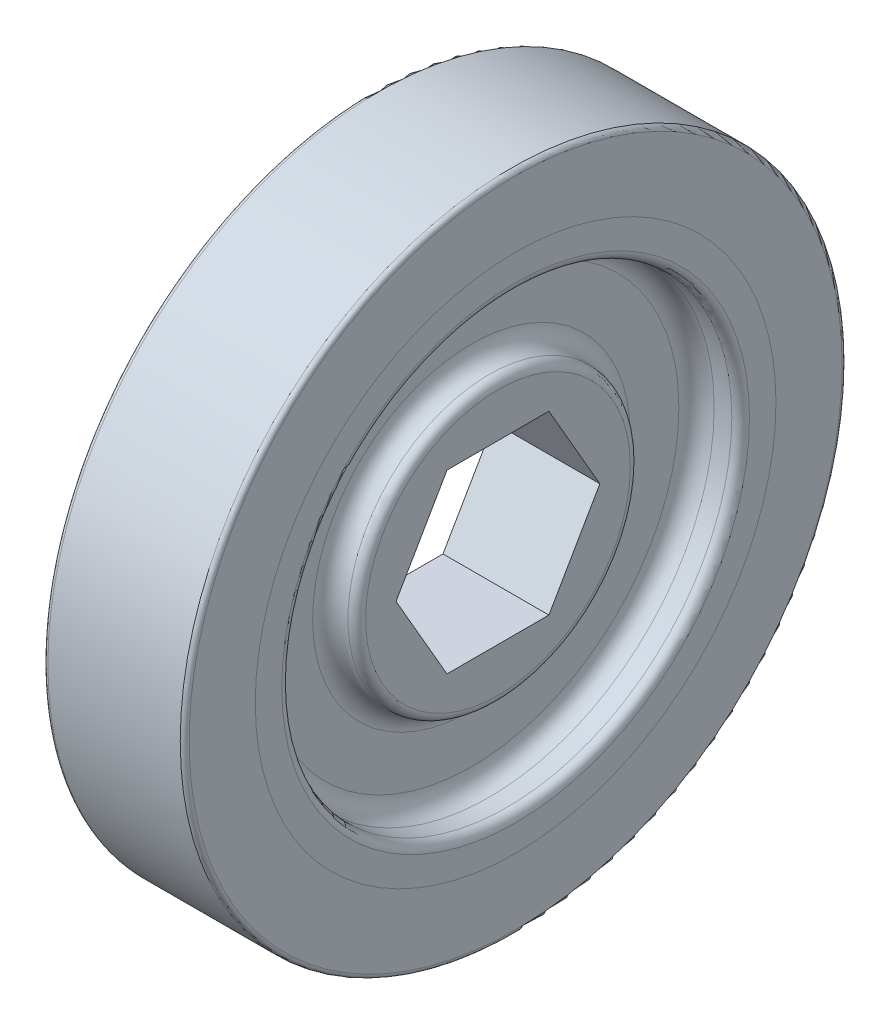
ISO-10303-21;
HEADER;
FILE_DESCRIPTION(('STEP AP214'),'2;1');
FILE_NAME('part.step','',(''),(''),'','','');
FILE_SCHEMA(('AUTOMOTIVE_DESIGN { 1 0 10303 214 1 1 1 1 }'));
ENDSEC;
DATA;
#1=APPLICATION_CONTEXT('core data for automotive mechanical design processes');
#2=APPLICATION_PROTOCOL_DEFINITION('international standard','automotive_design',2000,#1);
#3=PRODUCT_CONTEXT('',#1,'mechanical');
#4=PRODUCT('Part','Part','',(#3));
#5=PRODUCT_RELATED_PRODUCT_CATEGORY('part','',(#4));
#6=PRODUCT_DEFINITION_FORMATION('','',#4);
#7=PRODUCT_DEFINITION_CONTEXT('part definition',#1,'design');
#8=PRODUCT_DEFINITION('design','',#6,#7);
#9=PRODUCT_DEFINITION_SHAPE('','',#8);
#10=(LENGTH_UNIT() NAMED_UNIT(*) SI_UNIT(.MILLI.,.METRE.));
#11=(NAMED_UNIT(*) PLANE_ANGLE_UNIT() SI_UNIT($,.RADIAN.));
#12=(NAMED_UNIT(*) SI_UNIT($,.STERADIAN.) SOLID_ANGLE_UNIT());
#13=UNCERTAINTY_MEASURE_WITH_UNIT(LENGTH_MEASURE(1.E-05),#10,'distance_accuracy_value','');
#14=(GEOMETRIC_REPRESENTATION_CONTEXT(3) GLOBAL_UNCERTAINTY_ASSIGNED_CONTEXT((#13)) GLOBAL_UNIT_ASSIGNED_CONTEXT((#10,
#11,#12)) REPRESENTATION_CONTEXT('',''));
#15=CARTESIAN_POINT('',(0.,0.,0.));
#16=DIRECTION('',(0.,0.,1.));
#17=DIRECTION('',(1.,0.,0.));
#18=AXIS2_PLACEMENT_3D('',#15,#16,#17);
#19=CARTESIAN_POINT('',(4.7625,0.,0.));
#20=DIRECTION('',(1.,0.,0.));
#21=DIRECTION('',(0.,0.,-1.));
#22=AXIS2_PLACEMENT_3D('',#19,#20,#21);
#23=TOROIDAL_SURFACE('',#22,23.495,0.3175);
#24=CARTESIAN_POINT('',(4.7625,0.,0.));
#25=DIRECTION('',(-1.,0.,0.));
#26=DIRECTION('',(0.,0.,-1.));
#27=AXIS2_PLACEMENT_3D('',#24,#25,#26);
#28=CIRCLE('',#27,23.8125);
#29=CARTESIAN_POINT('',(4.7625,0.,-23.8125));
#30=VERTEX_POINT('',#29);
#31=EDGE_CURVE('P0_E26',#30,#30,#28,.T.);
#32=ORIENTED_EDGE('',*,*,#31,.F.);
#33=EDGE_LOOP('',(#32));
#34=FACE_BOUND('',#33,.T.);
#35=CARTESIAN_POINT('',(5.08,0.,0.));
#36=DIRECTION('',(1.,0.,0.));
#37=DIRECTION('',(0.,0.,-1.));
#38=AXIS2_PLACEMENT_3D('',#35,#36,#37);
#39=CIRCLE('',#38,23.495);
#40=CARTESIAN_POINT('',(5.08,0.,-23.495));
#41=VERTEX_POINT('',#40);
#42=EDGE_CURVE('P0_E86',#41,#41,#39,.T.);
#43=ORIENTED_EDGE('',*,*,#42,.F.);
#44=EDGE_LOOP('',(#43));
#45=FACE_BOUND('',#44,.T.);
#46=ADVANCED_FACE('P0_F16',(#34,#45),#23,.T.);
#47=CARTESIAN_POINT('',(-4.7625,0.,0.));
#48=DIRECTION('',(1.,0.,0.));
#49=DIRECTION('',(0.,0.,-1.));
#50=AXIS2_PLACEMENT_3D('',#47,#48,#49);
#51=TOROIDAL_SURFACE('',#50,23.495,0.3175);
#52=CARTESIAN_POINT('',(-5.08,0.,0.));
#53=DIRECTION('',(-1.,0.,0.));
#54=DIRECTION('',(0.,0.,-1.));
#55=AXIS2_PLACEMENT_3D('',#52,#53,#54);
#56=CIRCLE('',#55,23.495);
#57=CARTESIAN_POINT('',(-5.08,0.,-23.495));
#58=VERTEX_POINT('',#57);
#59=EDGE_CURVE('P0_E90',#58,#58,#56,.T.);
#60=ORIENTED_EDGE('',*,*,#59,.F.);
#61=EDGE_LOOP('',(#60));
#62=FACE_BOUND('',#61,.T.);
#63=CARTESIAN_POINT('',(-4.7625,0.,0.));
#64=DIRECTION('',(1.,0.,0.));
#65=DIRECTION('',(0.,0.,-1.));
#66=AXIS2_PLACEMENT_3D('',#63,#64,#65);
#67=CIRCLE('',#66,23.8125);
#68=CARTESIAN_POINT('',(-4.7625,0.,-23.8125));
#69=VERTEX_POINT('',#68);
#70=EDGE_CURVE('P0_E11',#69,#69,#67,.T.);
#71=ORIENTED_EDGE('',*,*,#70,.F.);
#72=EDGE_LOOP('',(#71));
#73=FACE_BOUND('',#72,.T.);
#74=ADVANCED_FACE('P0_F128',(#62,#73),#51,.T.);
#75=CARTESIAN_POINT('',(5.08,0.,0.));
#76=DIRECTION('',(1.,0.,0.));
#77=DIRECTION('',(0.,0.,1.));
#78=AXIS2_PLACEMENT_3D('',#75,#76,#77);
#79=CYLINDRICAL_SURFACE('',#78,23.8125);
#80=ORIENTED_EDGE('',*,*,#70,.T.);
#81=EDGE_LOOP('',(#80));
#82=FACE_BOUND('',#81,.T.);
#83=ORIENTED_EDGE('',*,*,#31,.T.);
#84=EDGE_LOOP('',(#83));
#85=FACE_BOUND('',#84,.T.);
#86=ADVANCED_FACE('P0_F133',(#82,#85),#79,.T.);
#87=CARTESIAN_POINT('',(-5.08,0.,0.));
#88=DIRECTION('',(1.,0.,0.));
#89=DIRECTION('',(0.,1.,0.));
#90=AXIS2_PLACEMENT_3D('',#87,#88,#89);
#91=PLANE('',#90);
#92=CARTESIAN_POINT('',(-5.08,0.,0.));
#93=DIRECTION('',(1.,0.,0.));
#94=DIRECTION('',(0.,0.,-1.));
#95=AXIS2_PLACEMENT_3D('',#92,#93,#94);
#96=CIRCLE('',#95,18.7325);
#97=CARTESIAN_POINT('',(-5.08,0.,-18.7325));
#98=VERTEX_POINT('',#97);
#99=EDGE_CURVE('P0_E20',#98,#98,#96,.T.);
#100=ORIENTED_EDGE('',*,*,#99,.T.);
#101=EDGE_LOOP('',(#100));
#102=FACE_BOUND('',#101,.T.);
#103=ORIENTED_EDGE('',*,*,#59,.T.);
#104=EDGE_LOOP('',(#103));
#105=FACE_BOUND('',#104,.T.);
#106=ADVANCED_FACE('P0_F124',(#102,#105),#91,.F.);
#107=CARTESIAN_POINT('',(5.08,0.,0.));
#108=DIRECTION('',(1.,0.,0.));
#109=DIRECTION('',(0.,1.,0.));
#110=AXIS2_PLACEMENT_3D('',#107,#108,#109);
#111=PLANE('',#110);
#112=CARTESIAN_POINT('',(5.08,0.,0.));
#113=DIRECTION('',(1.,0.,0.));
#114=DIRECTION('',(0.,0.,-1.));
#115=AXIS2_PLACEMENT_3D('',#112,#113,#114);
#116=CIRCLE('',#115,18.7325);
#117=CARTESIAN_POINT('',(5.08,0.,-18.7325));
#118=VERTEX_POINT('',#117);
#119=EDGE_CURVE('P0_E91',#118,#118,#116,.T.);
#120=ORIENTED_EDGE('',*,*,#119,.F.);
#121=EDGE_LOOP('',(#120));
#122=FACE_BOUND('',#121,.T.);
#123=ORIENTED_EDGE('',*,*,#42,.T.);
#124=EDGE_LOOP('',(#123));
#125=FACE_BOUND('',#124,.T.);
#126=ADVANCED_FACE('P0_F87',(#122,#125),#111,.T.);
#127=CARTESIAN_POINT('',(5.08,0.,0.));
#128=DIRECTION('',(1.,0.,0.));
#129=DIRECTION('',(0.,0.,1.));
#130=AXIS2_PLACEMENT_3D('',#127,#128,#129);
#131=CYLINDRICAL_SURFACE('',#130,18.7325);
#132=ORIENTED_EDGE('',*,*,#119,.T.);
#133=EDGE_LOOP('',(#132));
#134=FACE_BOUND('',#133,.T.);
#135=CARTESIAN_POINT('',(2.54,0.,0.));
#136=DIRECTION('',(1.,0.,0.));
#137=DIRECTION('',(0.,0.,-1.));
#138=AXIS2_PLACEMENT_3D('',#135,#136,#137);
#139=CIRCLE('',#138,18.7325);
#140=CARTESIAN_POINT('',(2.54,0.,-18.7325));
#141=VERTEX_POINT('',#140);
#142=EDGE_CURVE('P0_E98',#141,#141,#139,.T.);
#143=ORIENTED_EDGE('',*,*,#142,.F.);
#144=EDGE_LOOP('',(#143));
#145=FACE_BOUND('',#144,.T.);
#146=ADVANCED_FACE('P0_F18',(#134,#145),#131,.F.);
#147=CARTESIAN_POINT('',(2.54,0.,0.));
#148=DIRECTION('',(1.,0.,0.));
#149=DIRECTION('',(0.,1.,0.));
#150=AXIS2_PLACEMENT_3D('',#147,#148,#149);
#151=PLANE('',#150);
#152=ORIENTED_EDGE('',*,*,#142,.T.);
#153=EDGE_LOOP('',(#152));
#154=FACE_BOUND('',#153,.T.);
#155=CARTESIAN_POINT('',(2.54,0.,0.));
#156=DIRECTION('',(1.,0.,0.));
#157=DIRECTION('',(0.,0.,-1.));
#158=AXIS2_PLACEMENT_3D('',#155,#156,#157);
#159=CIRCLE('',#158,21.2725);
#160=CARTESIAN_POINT('',(2.54,0.,-21.2725));
#161=VERTEX_POINT('',#160);
#162=EDGE_CURVE('P0_E57',#161,#161,#159,.T.);
#163=ORIENTED_EDGE('',*,*,#162,.F.);
#164=EDGE_LOOP('',(#163));
#165=FACE_BOUND('',#164,.T.);
#166=ADVANCED_FACE('P0_F112',(#154,#165),#151,.F.);
#167=CARTESIAN_POINT('',(5.08,0.,0.));
#168=DIRECTION('',(1.,0.,0.));
#169=DIRECTION('',(0.,0.,1.));
#170=AXIS2_PLACEMENT_3D('',#167,#168,#169);
#171=CYLINDRICAL_SURFACE('',#170,21.2725);
#172=CARTESIAN_POINT('',(-2.54,0.,0.));
#173=DIRECTION('',(1.,0.,0.));
#174=DIRECTION('',(0.,0.,-1.));
#175=AXIS2_PLACEMENT_3D('',#172,#173,#174);
#176=CIRCLE('',#175,21.2725);
#177=CARTESIAN_POINT('',(-2.54,0.,-21.2725));
#178=VERTEX_POINT('',#177);
#179=EDGE_CURVE('P0_E66',#178,#178,#176,.T.);
#180=ORIENTED_EDGE('',*,*,#179,.F.);
#181=EDGE_LOOP('',(#180));
#182=FACE_BOUND('',#181,.T.);
#183=ORIENTED_EDGE('',*,*,#162,.T.);
#184=EDGE_LOOP('',(#183));
#185=FACE_BOUND('',#184,.T.);
#186=ADVANCED_FACE('P0_F122',(#182,#185),#171,.F.);
#187=CARTESIAN_POINT('',(-2.54,0.,0.));
#188=DIRECTION('',(1.,0.,0.));
#189=DIRECTION('',(0.,1.,0.));
#190=AXIS2_PLACEMENT_3D('',#187,#188,#189);
#191=PLANE('',#190);
#192=CARTESIAN_POINT('',(-2.54,0.,0.));
#193=DIRECTION('',(1.,0.,0.));
#194=DIRECTION('',(0.,0.,-1.));
#195=AXIS2_PLACEMENT_3D('',#192,#193,#194);
#196=CIRCLE('',#195,18.7325);
#197=CARTESIAN_POINT('',(-2.54,0.,-18.7325));
#198=VERTEX_POINT('',#197);
#199=EDGE_CURVE('P0_E154',#198,#198,#196,.T.);
#200=ORIENTED_EDGE('',*,*,#199,.F.);
#201=EDGE_LOOP('',(#200));
#202=FACE_BOUND('',#201,.T.);
#203=ORIENTED_EDGE('',*,*,#179,.T.);
#204=EDGE_LOOP('',(#203));
#205=FACE_BOUND('',#204,.T.);
#206=ADVANCED_FACE('P0_F139',(#202,#205),#191,.T.);
#207=CARTESIAN_POINT('',(-5.08,0.,0.));
#208=DIRECTION('',(-1.,0.,0.));
#209=DIRECTION('',(0.,0.,-1.));
#210=AXIS2_PLACEMENT_3D('',#207,#208,#209);
#211=CYLINDRICAL_SURFACE('',#210,18.7325);
#212=ORIENTED_EDGE('',*,*,#99,.F.);
#213=EDGE_LOOP('',(#212));
#214=FACE_BOUND('',#213,.T.);
#215=ORIENTED_EDGE('',*,*,#199,.T.);
#216=EDGE_LOOP('',(#215));
#217=FACE_BOUND('',#216,.T.);
#218=ADVANCED_FACE('P0_F141',(#214,#217),#211,.F.);
#219=CLOSED_SHELL('',(#46,#74,#86,#106,#126,#146,#166,#186,#206,#218));
#220=MANIFOLD_SOLID_BREP('P0_B1',#219);
#221=CARTESIAN_POINT('',(1.905,0.,0.));
#222=DIRECTION('',(1.,0.,0.));
#223=DIRECTION('',(0.,1.,0.));
#224=AXIS2_PLACEMENT_3D('',#221,#222,#223);
#225=PLANE('',#224);
#226=CARTESIAN_POINT('',(1.905,0.,0.));
#227=DIRECTION('',(-1.,0.,0.));
#228=DIRECTION('',(0.,0.,-1.));
#229=AXIS2_PLACEMENT_3D('',#226,#227,#228);
#230=CIRCLE('',#229,11.43);
#231=CARTESIAN_POINT('',(1.905,0.,-11.43));
#232=VERTEX_POINT('',#231);
#233=EDGE_CURVE('P1_E206',#232,#232,#230,.T.);
#234=ORIENTED_EDGE('',*,*,#233,.T.);
#235=EDGE_LOOP('',(#234));
#236=FACE_BOUND('',#235,.T.);
#237=CARTESIAN_POINT('',(1.905,0.,0.));
#238=DIRECTION('',(1.,0.,0.));
#239=DIRECTION('',(0.,0.,-1.));
#240=AXIS2_PLACEMENT_3D('',#237,#238,#239);
#241=CIRCLE('',#240,14.9225);
#242=CARTESIAN_POINT('',(1.905,0.,-14.9225));
#243=VERTEX_POINT('',#242);
#244=EDGE_CURVE('P1_E207',#243,#243,#241,.T.);
#245=ORIENTED_EDGE('',*,*,#244,.T.);
#246=EDGE_LOOP('',(#245));
#247=FACE_BOUND('',#246,.T.);
#248=ADVANCED_FACE('P1_F16',(#236,#247),#225,.T.);
#249=CARTESIAN_POINT('',(-3.81,0.,0.));
#250=DIRECTION('',(1.,0.,0.));
#251=DIRECTION('',(0.,1.,0.));
#252=AXIS2_PLACEMENT_3D('',#249,#250,#251);
#253=PLANE('',#252);
#254=DIRECTION('',(0.,0.,1.));
#255=VECTOR('',#254,1.);
#256=CARTESIAN_POINT('',(-3.81,6.35,0.));
#257=LINE('',#256,#255);
#258=CARTESIAN_POINT('',(-3.81,6.35,-3.66617420935413));
#259=VERTEX_POINT('',#258);
#260=CARTESIAN_POINT('',(-3.81,6.35,3.66617420935413));
#261=VERTEX_POINT('',#260);
#262=EDGE_CURVE('P1_E203',#259,#261,#257,.T.);
#263=ORIENTED_EDGE('',*,*,#262,.T.);
#264=DIRECTION('',(0.,-0.866025403784439,0.5));
#265=VECTOR('',#264,1.);
#266=CARTESIAN_POINT('',(-3.81,3.175,5.49926131403119));
#267=LINE('',#266,#265);
#268=CARTESIAN_POINT('',(-3.81,0.,7.33234841870825));
#269=VERTEX_POINT('',#268);
#270=EDGE_CURVE('P1_E99',#261,#269,#267,.T.);
#271=ORIENTED_EDGE('',*,*,#270,.T.);
#272=DIRECTION('',(0.,-0.866025403784439,-0.5));
#273=VECTOR('',#272,1.);
#274=CARTESIAN_POINT('',(-3.81,-3.175,5.49926131403119));
#275=LINE('',#274,#273);
#276=CARTESIAN_POINT('',(-3.81,-6.35,3.66617420935413));
#277=VERTEX_POINT('',#276);
#278=EDGE_CURVE('P1_E253',#269,#277,#275,.T.);
#279=ORIENTED_EDGE('',*,*,#278,.T.);
#280=DIRECTION('',(0.,0.,-1.));
#281=VECTOR('',#280,1.);
#282=CARTESIAN_POINT('',(-3.81,-6.35,0.));
#283=LINE('',#282,#281);
#284=CARTESIAN_POINT('',(-3.81,-6.35,-3.66617420935412));
#285=VERTEX_POINT('',#284);
#286=EDGE_CURVE('P1_E349',#277,#285,#283,.T.);
#287=ORIENTED_EDGE('',*,*,#286,.T.);
#288=DIRECTION('',(0.,0.866025403784439,-0.5));
#289=VECTOR('',#288,1.);
#290=CARTESIAN_POINT('',(-3.81,-3.175,-5.49926131403118));
#291=LINE('',#290,#289);
#292=CARTESIAN_POINT('',(-3.81,0.,-7.33234841870825));
#293=VERTEX_POINT('',#292);
#294=EDGE_CURVE('P1_E246',#285,#293,#291,.T.);
#295=ORIENTED_EDGE('',*,*,#294,.T.);
#296=DIRECTION('',(0.,0.866025403784439,0.5));
#297=VECTOR('',#296,1.);
#298=CARTESIAN_POINT('',(-3.81,3.175,-5.49926131403119));
#299=LINE('',#298,#297);
#300=EDGE_CURVE('P1_E216',#293,#259,#299,.T.);
#301=ORIENTED_EDGE('',*,*,#300,.T.);
#302=EDGE_LOOP('',(#263,#271,#279,#287,#295,#301));
#303=FACE_BOUND('',#302,.T.);
#304=CARTESIAN_POINT('',(-3.81,0.,0.));
#305=DIRECTION('',(-1.,0.,0.));
#306=DIRECTION('',(0.,0.,-1.));
#307=AXIS2_PLACEMENT_3D('',#304,#305,#306);
#308=CIRCLE('',#307,9.525);
#309=CARTESIAN_POINT('',(-3.81,0.,-9.525));
#310=VERTEX_POINT('',#309);
#311=EDGE_CURVE('P1_E177',#310,#310,#308,.T.);
#312=ORIENTED_EDGE('',*,*,#311,.T.);
#313=EDGE_LOOP('',(#312));
#314=FACE_BOUND('',#313,.T.);
#315=ADVANCED_FACE('P1_F178',(#303,#314),#253,.F.);
#316=CARTESIAN_POINT('',(-5.08,0.,0.));
#317=DIRECTION('',(1.,0.,0.));
#318=DIRECTION('',(0.,1.,0.));
#319=AXIS2_PLACEMENT_3D('',#316,#317,#318);
#320=PLANE('',#319);
#321=CARTESIAN_POINT('',(-5.08,0.,0.));
#322=DIRECTION('',(1.,0.,0.));
#323=DIRECTION('',(0.,0.,-1.));
#324=AXIS2_PLACEMENT_3D('',#321,#322,#323);
#325=CIRCLE('',#324,16.8275);
#326=CARTESIAN_POINT('',(-5.08,0.,-16.8275));
#327=VERTEX_POINT('',#326);
#328=EDGE_CURVE('P1_E213',#327,#327,#325,.T.);
#329=ORIENTED_EDGE('',*,*,#328,.T.);
#330=EDGE_LOOP('',(#329));
#331=FACE_BOUND('',#330,.T.);
#332=CARTESIAN_POINT('',(-5.08,0.,0.));
#333=DIRECTION('',(1.,0.,0.));
#334=DIRECTION('',(0.,0.,-1.));
#335=AXIS2_PLACEMENT_3D('',#332,#333,#334);
#336=CIRCLE('',#335,18.7325);
#337=CARTESIAN_POINT('',(-5.08,0.,-18.7325));
#338=VERTEX_POINT('',#337);
#339=EDGE_CURVE('P1_E240',#338,#338,#336,.T.);
#340=ORIENTED_EDGE('',*,*,#339,.F.);
#341=EDGE_LOOP('',(#340));
#342=FACE_BOUND('',#341,.T.);
#343=ADVANCED_FACE('P1_F300',(#331,#342),#320,.F.);
#344=CARTESIAN_POINT('',(2.54,0.,0.));
#345=DIRECTION('',(1.,0.,0.));
#346=DIRECTION('',(0.,0.,1.));
#347=AXIS2_PLACEMENT_3D('',#344,#345,#346);
#348=CYLINDRICAL_SURFACE('',#347,21.2725);
#349=CARTESIAN_POINT('',(2.54,0.,0.));
#350=DIRECTION('',(1.,0.,0.));
#351=DIRECTION('',(0.,0.,-1.));
#352=AXIS2_PLACEMENT_3D('',#349,#350,#351);
#353=CIRCLE('',#352,21.2725);
#354=CARTESIAN_POINT('',(2.54,0.,-21.2725));
#355=VERTEX_POINT('',#354);
#356=EDGE_CURVE('P1_E11',#355,#355,#353,.T.);
#357=ORIENTED_EDGE('',*,*,#356,.F.);
#358=EDGE_LOOP('',(#357));
#359=FACE_BOUND('',#358,.T.);
#360=CARTESIAN_POINT('',(-2.54,0.,0.));
#361=DIRECTION('',(1.,0.,0.));
#362=DIRECTION('',(0.,0.,-1.));
#363=AXIS2_PLACEMENT_3D('',#360,#361,#362);
#364=CIRCLE('',#363,21.2725);
#365=CARTESIAN_POINT('',(-2.54,0.,-21.2725));
#366=VERTEX_POINT('',#365);
#367=EDGE_CURVE('P1_E27',#366,#366,#364,.T.);
#368=ORIENTED_EDGE('',*,*,#367,.T.);
#369=EDGE_LOOP('',(#368));
#370=FACE_BOUND('',#369,.T.);
#371=ADVANCED_FACE('P1_F305',(#359,#370),#348,.T.);
#372=CARTESIAN_POINT('',(2.54,0.,0.));
#373=DIRECTION('',(1.,0.,0.));
#374=DIRECTION('',(0.,1.,0.));
#375=AXIS2_PLACEMENT_3D('',#372,#373,#374);
#376=PLANE('',#375);
#377=CARTESIAN_POINT('',(2.54,0.,0.));
#378=DIRECTION('',(1.,0.,0.));
#379=DIRECTION('',(0.,0.,-1.));
#380=AXIS2_PLACEMENT_3D('',#377,#378,#379);
#381=CIRCLE('',#380,18.7325);
#382=CARTESIAN_POINT('',(2.54,0.,-18.7325));
#383=VERTEX_POINT('',#382);
#384=EDGE_CURVE('P1_E196',#383,#383,#381,.T.);
#385=ORIENTED_EDGE('',*,*,#384,.F.);
#386=EDGE_LOOP('',(#385));
#387=FACE_BOUND('',#386,.T.);
#388=ORIENTED_EDGE('',*,*,#356,.T.);
#389=EDGE_LOOP('',(#388));
#390=FACE_BOUND('',#389,.T.);
#391=ADVANCED_FACE('P1_F383',(#387,#390),#376,.T.);
#392=CARTESIAN_POINT('',(-2.54,0.,0.));
#393=DIRECTION('',(1.,0.,0.));
#394=DIRECTION('',(0.,1.,0.));
#395=AXIS2_PLACEMENT_3D('',#392,#393,#394);
#396=PLANE('',#395);
#397=CARTESIAN_POINT('',(-2.54,0.,0.));
#398=DIRECTION('',(1.,0.,0.));
#399=DIRECTION('',(0.,0.,-1.));
#400=AXIS2_PLACEMENT_3D('',#397,#398,#399);
#401=CIRCLE('',#400,18.7325);
#402=CARTESIAN_POINT('',(-2.54,0.,-18.7325));
#403=VERTEX_POINT('',#402);
#404=EDGE_CURVE('P1_E53',#403,#403,#401,.T.);
#405=ORIENTED_EDGE('',*,*,#404,.T.);
#406=EDGE_LOOP('',(#405));
#407=FACE_BOUND('',#406,.T.);
#408=ORIENTED_EDGE('',*,*,#367,.F.);
#409=EDGE_LOOP('',(#408));
#410=FACE_BOUND('',#409,.T.);
#411=ADVANCED_FACE('P1_F311',(#407,#410),#396,.F.);
#412=CARTESIAN_POINT('',(3.175,0.,0.));
#413=DIRECTION('',(1.,0.,0.));
#414=DIRECTION('',(0.,0.,-1.));
#415=AXIS2_PLACEMENT_3D('',#412,#413,#414);
#416=TOROIDAL_SURFACE('',#415,9.525,0.635);
#417=CARTESIAN_POINT('',(3.175,0.,0.));
#418=DIRECTION('',(1.,0.,0.));
#419=DIRECTION('',(0.,0.,-1.));
#420=AXIS2_PLACEMENT_3D('',#417,#418,#419);
#421=CIRCLE('',#420,10.16);
#422=CARTESIAN_POINT('',(3.175,0.,-10.16));
#423=VERTEX_POINT('',#422);
#424=EDGE_CURVE('P1_E204',#423,#423,#421,.T.);
#425=ORIENTED_EDGE('',*,*,#424,.T.);
#426=EDGE_LOOP('',(#425));
#427=FACE_BOUND('',#426,.T.);
#428=CARTESIAN_POINT('',(3.81,0.,0.));
#429=DIRECTION('',(1.,0.,0.));
#430=DIRECTION('',(0.,0.,-1.));
#431=AXIS2_PLACEMENT_3D('',#428,#429,#430);
#432=CIRCLE('',#431,9.525);
#433=CARTESIAN_POINT('',(3.81,0.,-9.525));
#434=VERTEX_POINT('',#433);
#435=EDGE_CURVE('P1_E263',#434,#434,#432,.T.);
#436=ORIENTED_EDGE('',*,*,#435,.F.);
#437=EDGE_LOOP('',(#436));
#438=FACE_BOUND('',#437,.T.);
#439=ADVANCED_FACE('P1_F307',(#427,#438),#416,.T.);
#440=CARTESIAN_POINT('',(4.445,0.,0.));
#441=DIRECTION('',(1.,0.,0.));
#442=DIRECTION('',(0.,0.,-1.));
#443=AXIS2_PLACEMENT_3D('',#440,#441,#442);
#444=TOROIDAL_SURFACE('',#443,16.8275,0.635);
#445=CARTESIAN_POINT('',(5.08,0.,0.));
#446=DIRECTION('',(-1.,0.,0.));
#447=DIRECTION('',(0.,0.,-1.));
#448=AXIS2_PLACEMENT_3D('',#445,#446,#447);
#449=CIRCLE('',#448,16.8275);
#450=CARTESIAN_POINT('',(5.08,0.,-16.8275));
#451=VERTEX_POINT('',#450);
#452=EDGE_CURVE('P1_E193',#451,#451,#449,.T.);
#453=ORIENTED_EDGE('',*,*,#452,.F.);
#454=EDGE_LOOP('',(#453));
#455=FACE_BOUND('',#454,.T.);
#456=CARTESIAN_POINT('',(4.445,0.,0.));
#457=DIRECTION('',(1.,0.,0.));
#458=DIRECTION('',(0.,0.,-1.));
#459=AXIS2_PLACEMENT_3D('',#456,#457,#458);
#460=CIRCLE('',#459,16.1925);
#461=CARTESIAN_POINT('',(4.445,0.,-16.1925));
#462=VERTEX_POINT('',#461);
#463=EDGE_CURVE('P1_E67',#462,#462,#460,.T.);
#464=ORIENTED_EDGE('',*,*,#463,.F.);
#465=EDGE_LOOP('',(#464));
#466=FACE_BOUND('',#465,.T.);
#467=ADVANCED_FACE('P1_F310',(#455,#466),#444,.T.);
#468=CARTESIAN_POINT('',(-4.445,0.,0.));
#469=DIRECTION('',(1.,0.,0.));
#470=DIRECTION('',(0.,0.,-1.));
#471=AXIS2_PLACEMENT_3D('',#468,#469,#470);
#472=TOROIDAL_SURFACE('',#471,16.8275,0.635);
#473=CARTESIAN_POINT('',(-4.445,0.,0.));
#474=DIRECTION('',(-1.,0.,0.));
#475=DIRECTION('',(0.,0.,-1.));
#476=AXIS2_PLACEMENT_3D('',#473,#474,#475);
#477=CIRCLE('',#476,16.1925);
#478=CARTESIAN_POINT('',(-4.445,0.,-16.1925));
#479=VERTEX_POINT('',#478);
#480=EDGE_CURVE('P1_E242',#479,#479,#477,.T.);
#481=ORIENTED_EDGE('',*,*,#480,.F.);
#482=EDGE_LOOP('',(#481));
#483=FACE_BOUND('',#482,.T.);
#484=ORIENTED_EDGE('',*,*,#328,.F.);
#485=EDGE_LOOP('',(#484));
#486=FACE_BOUND('',#485,.T.);
#487=ADVANCED_FACE('P1_F403',(#483,#486),#472,.T.);
#488=CARTESIAN_POINT('',(3.175,0.,0.));
#489=DIRECTION('',(1.,0.,0.));
#490=DIRECTION('',(0.,0.,-1.));
#491=AXIS2_PLACEMENT_3D('',#488,#489,#490);
#492=TOROIDAL_SURFACE('',#491,11.43,1.27);
#493=ORIENTED_EDGE('',*,*,#233,.F.);
#494=EDGE_LOOP('',(#493));
#495=FACE_BOUND('',#494,.T.);
#496=ORIENTED_EDGE('',*,*,#424,.F.);
#497=EDGE_LOOP('',(#496));
#498=FACE_BOUND('',#497,.T.);
#499=ADVANCED_FACE('P1_F406',(#495,#498),#492,.F.);
#500=CARTESIAN_POINT('',(3.175,0.,0.));
#501=DIRECTION('',(1.,0.,0.));
#502=DIRECTION('',(0.,0.,-1.));
#503=AXIS2_PLACEMENT_3D('',#500,#501,#502);
#504=TOROIDAL_SURFACE('',#503,14.9225,1.27);
#505=ORIENTED_EDGE('',*,*,#244,.F.);
#506=EDGE_LOOP('',(#505));
#507=FACE_BOUND('',#506,.T.);
#508=CARTESIAN_POINT('',(3.175,0.,0.));
#509=DIRECTION('',(-1.,0.,0.));
#510=DIRECTION('',(0.,0.,-1.));
#511=AXIS2_PLACEMENT_3D('',#508,#509,#510);
#512=CIRCLE('',#511,16.1925);
#513=CARTESIAN_POINT('',(3.175,0.,-16.1925));
#514=VERTEX_POINT('',#513);
#515=EDGE_CURVE('P1_E245',#514,#514,#512,.T.);
#516=ORIENTED_EDGE('',*,*,#515,.F.);
#517=EDGE_LOOP('',(#516));
#518=FACE_BOUND('',#517,.T.);
#519=ADVANCED_FACE('P1_F18',(#507,#518),#504,.F.);
#520=CARTESIAN_POINT('',(3.81,3.175,-5.49926131403119));
#521=DIRECTION('',(0.,-0.5,0.866025403784439));
#522=DIRECTION('',(-1.,0.,0.));
#523=AXIS2_PLACEMENT_3D('',#520,#521,#522);
#524=PLANE('',#523);
#525=ORIENTED_EDGE('',*,*,#300,.F.);
#526=DIRECTION('',(-1.,0.,0.));
#527=VECTOR('',#526,1.);
#528=CARTESIAN_POINT('',(3.81,0.,-7.33234841870825));
#529=LINE('',#528,#527);
#530=CARTESIAN_POINT('',(3.81,0.,-7.33234841870825));
#531=VERTEX_POINT('',#530);
#532=EDGE_CURVE('P1_E224',#531,#293,#529,.T.);
#533=ORIENTED_EDGE('',*,*,#532,.F.);
#534=DIRECTION('',(0.,0.866025403784439,0.5));
#535=VECTOR('',#534,1.);
#536=CARTESIAN_POINT('',(3.81,3.175,-5.49926131403119));
#537=LINE('',#536,#535);
#538=CARTESIAN_POINT('',(3.81,6.35,-3.66617420935413));
#539=VERTEX_POINT('',#538);
#540=EDGE_CURVE('P1_E84',#531,#539,#537,.T.);
#541=ORIENTED_EDGE('',*,*,#540,.T.);
#542=DIRECTION('',(-1.,0.,0.));
#543=VECTOR('',#542,1.);
#544=CARTESIAN_POINT('',(3.81,6.35,-3.66617420935413));
#545=LINE('',#544,#543);
#546=EDGE_CURVE('P1_E200',#539,#259,#545,.T.);
#547=ORIENTED_EDGE('',*,*,#546,.T.);
#548=EDGE_LOOP('',(#525,#533,#541,#547));
#549=FACE_BOUND('',#548,.T.);
#550=ADVANCED_FACE('P1_F391',(#549),#524,.T.);
#551=CARTESIAN_POINT('',(3.81,-3.175,-5.49926131403118));
#552=DIRECTION('',(0.,0.5,0.866025403784439));
#553=DIRECTION('',(1.,0.,0.));
#554=AXIS2_PLACEMENT_3D('',#551,#552,#553);
#555=PLANE('',#554);
#556=ORIENTED_EDGE('',*,*,#294,.F.);
#557=DIRECTION('',(-1.,0.,0.));
#558=VECTOR('',#557,1.);
#559=CARTESIAN_POINT('',(3.81,-6.35,-3.66617420935412));
#560=LINE('',#559,#558);
#561=CARTESIAN_POINT('',(3.81,-6.35,-3.66617420935412));
#562=VERTEX_POINT('',#561);
#563=EDGE_CURVE('P1_E250',#562,#285,#560,.T.);
#564=ORIENTED_EDGE('',*,*,#563,.F.);
#565=DIRECTION('',(0.,0.866025403784439,-0.5));
#566=VECTOR('',#565,1.);
#567=CARTESIAN_POINT('',(3.81,-3.175,-5.49926131403118));
#568=LINE('',#567,#566);
#569=EDGE_CURVE('P1_E237',#562,#531,#568,.T.);
#570=ORIENTED_EDGE('',*,*,#569,.T.);
#571=ORIENTED_EDGE('',*,*,#532,.T.);
#572=EDGE_LOOP('',(#556,#564,#570,#571));
#573=FACE_BOUND('',#572,.T.);
#574=ADVANCED_FACE('P1_F389',(#573),#555,.T.);
#575=CARTESIAN_POINT('',(3.81,-6.35,0.));
#576=DIRECTION('',(0.,1.,0.));
#577=DIRECTION('',(0.,0.,-1.));
#578=AXIS2_PLACEMENT_3D('',#575,#576,#577);
#579=PLANE('',#578);
#580=ORIENTED_EDGE('',*,*,#286,.F.);
#581=DIRECTION('',(-1.,0.,0.));
#582=VECTOR('',#581,1.);
#583=CARTESIAN_POINT('',(3.81,-6.35,3.66617420935413));
#584=LINE('',#583,#582);
#585=CARTESIAN_POINT('',(3.81,-6.35,3.66617420935413));
#586=VERTEX_POINT('',#585);
#587=EDGE_CURVE('P1_E257',#586,#277,#584,.T.);
#588=ORIENTED_EDGE('',*,*,#587,.F.);
#589=DIRECTION('',(0.,0.,-1.));
#590=VECTOR('',#589,1.);
#591=CARTESIAN_POINT('',(3.81,-6.35,0.));
#592=LINE('',#591,#590);
#593=EDGE_CURVE('P1_E232',#586,#562,#592,.T.);
#594=ORIENTED_EDGE('',*,*,#593,.T.);
#595=ORIENTED_EDGE('',*,*,#563,.T.);
#596=EDGE_LOOP('',(#580,#588,#594,#595));
#597=FACE_BOUND('',#596,.T.);
#598=ADVANCED_FACE('P1_F331',(#597),#579,.T.);
#599=CARTESIAN_POINT('',(3.81,-3.175,5.49926131403119));
#600=DIRECTION('',(0.,0.5,-0.866025403784439));
#601=DIRECTION('',(-1.,0.,0.));
#602=AXIS2_PLACEMENT_3D('',#599,#600,#601);
#603=PLANE('',#602);
#604=ORIENTED_EDGE('',*,*,#278,.F.);
#605=DIRECTION('',(-1.,0.,0.));
#606=VECTOR('',#605,1.);
#607=CARTESIAN_POINT('',(3.81,0.,7.33234841870825));
#608=LINE('',#607,#606);
#609=CARTESIAN_POINT('',(3.81,0.,7.33234841870825));
#610=VERTEX_POINT('',#609);
#611=EDGE_CURVE('P1_E260',#610,#269,#608,.T.);
#612=ORIENTED_EDGE('',*,*,#611,.F.);
#613=DIRECTION('',(0.,-0.866025403784439,-0.5));
#614=VECTOR('',#613,1.);
#615=CARTESIAN_POINT('',(3.81,-3.175,5.49926131403119));
#616=LINE('',#615,#614);
#617=EDGE_CURVE('P1_E236',#610,#586,#616,.T.);
#618=ORIENTED_EDGE('',*,*,#617,.T.);
#619=ORIENTED_EDGE('',*,*,#587,.T.);
#620=EDGE_LOOP('',(#604,#612,#618,#619));
#621=FACE_BOUND('',#620,.T.);
#622=ADVANCED_FACE('P1_F323',(#621),#603,.T.);
#623=CARTESIAN_POINT('',(3.81,0.,0.));
#624=DIRECTION('',(1.,0.,0.));
#625=DIRECTION('',(0.,1.,0.));
#626=AXIS2_PLACEMENT_3D('',#623,#624,#625);
#627=PLANE('',#626);
#628=DIRECTION('',(0.,0.,1.));
#629=VECTOR('',#628,1.);
#630=CARTESIAN_POINT('',(3.81,6.35,0.));
#631=LINE('',#630,#629);
#632=CARTESIAN_POINT('',(3.81,6.35,3.66617420935413));
#633=VERTEX_POINT('',#632);
#634=EDGE_CURVE('P1_E202',#539,#633,#631,.T.);
#635=ORIENTED_EDGE('',*,*,#634,.F.);
#636=ORIENTED_EDGE('',*,*,#540,.F.);
#637=ORIENTED_EDGE('',*,*,#569,.F.);
#638=ORIENTED_EDGE('',*,*,#593,.F.);
#639=ORIENTED_EDGE('',*,*,#617,.F.);
#640=DIRECTION('',(0.,-0.866025403784439,0.5));
#641=VECTOR('',#640,1.);
#642=CARTESIAN_POINT('',(3.81,3.175,5.49926131403119));
#643=LINE('',#642,#641);
#644=EDGE_CURVE('P1_E199',#633,#610,#643,.T.);
#645=ORIENTED_EDGE('',*,*,#644,.F.);
#646=EDGE_LOOP('',(#635,#636,#637,#638,#639,#645));
#647=FACE_BOUND('',#646,.T.);
#648=ORIENTED_EDGE('',*,*,#435,.T.);
#649=EDGE_LOOP('',(#648));
#650=FACE_BOUND('',#649,.T.);
#651=ADVANCED_FACE('P1_F320',(#647,#650),#627,.T.);
#652=CARTESIAN_POINT('',(3.81,3.175,5.49926131403119));
#653=DIRECTION('',(0.,-0.5,-0.866025403784439));
#654=DIRECTION('',(0.,-0.866025403784439,0.5));
#655=AXIS2_PLACEMENT_3D('',#652,#653,#654);
#656=PLANE('',#655);
#657=ORIENTED_EDGE('',*,*,#270,.F.);
#658=DIRECTION('',(-1.,0.,0.));
#659=VECTOR('',#658,1.);
#660=CARTESIAN_POINT('',(3.81,6.35,3.66617420935413));
#661=LINE('',#660,#659);
#662=EDGE_CURVE('P1_E229',#633,#261,#661,.T.);
#663=ORIENTED_EDGE('',*,*,#662,.F.);
#664=ORIENTED_EDGE('',*,*,#644,.T.);
#665=ORIENTED_EDGE('',*,*,#611,.T.);
#666=EDGE_LOOP('',(#657,#663,#664,#665));
#667=FACE_BOUND('',#666,.T.);
#668=ADVANCED_FACE('P1_F322',(#667),#656,.T.);
#669=CARTESIAN_POINT('',(5.08,0.,0.));
#670=DIRECTION('',(1.,0.,0.));
#671=DIRECTION('',(0.,1.,0.));
#672=AXIS2_PLACEMENT_3D('',#669,#670,#671);
#673=PLANE('',#672);
#674=ORIENTED_EDGE('',*,*,#452,.T.);
#675=EDGE_LOOP('',(#674));
#676=FACE_BOUND('',#675,.T.);
#677=CARTESIAN_POINT('',(5.08,0.,0.));
#678=DIRECTION('',(1.,0.,0.));
#679=DIRECTION('',(0.,0.,-1.));
#680=AXIS2_PLACEMENT_3D('',#677,#678,#679);
#681=CIRCLE('',#680,18.7325);
#682=CARTESIAN_POINT('',(5.08,0.,-18.7325));
#683=VERTEX_POINT('',#682);
#684=EDGE_CURVE('P1_E231',#683,#683,#681,.T.);
#685=ORIENTED_EDGE('',*,*,#684,.T.);
#686=EDGE_LOOP('',(#685));
#687=FACE_BOUND('',#686,.T.);
#688=ADVANCED_FACE('P1_F329',(#676,#687),#673,.T.);
#689=CARTESIAN_POINT('',(5.08,0.,0.));
#690=DIRECTION('',(1.,0.,0.));
#691=DIRECTION('',(0.,0.,1.));
#692=AXIS2_PLACEMENT_3D('',#689,#690,#691);
#693=CYLINDRICAL_SURFACE('',#692,18.7325);
#694=ORIENTED_EDGE('',*,*,#384,.T.);
#695=EDGE_LOOP('',(#694));
#696=FACE_BOUND('',#695,.T.);
#697=ORIENTED_EDGE('',*,*,#684,.F.);
#698=EDGE_LOOP('',(#697));
#699=FACE_BOUND('',#698,.T.);
#700=ADVANCED_FACE('P1_F318',(#696,#699),#693,.T.);
#701=CARTESIAN_POINT('',(3.81,6.35,0.));
#702=DIRECTION('',(0.,-1.,0.));
#703=DIRECTION('',(0.,0.,-1.));
#704=AXIS2_PLACEMENT_3D('',#701,#702,#703);
#705=PLANE('',#704);
#706=ORIENTED_EDGE('',*,*,#262,.F.);
#707=ORIENTED_EDGE('',*,*,#546,.F.);
#708=ORIENTED_EDGE('',*,*,#634,.T.);
#709=ORIENTED_EDGE('',*,*,#662,.T.);
#710=EDGE_LOOP('',(#706,#707,#708,#709));
#711=FACE_BOUND('',#710,.T.);
#712=ADVANCED_FACE('P1_F315',(#711),#705,.T.);
#713=CARTESIAN_POINT('',(5.08,0.,0.));
#714=DIRECTION('',(1.,0.,0.));
#715=DIRECTION('',(0.,0.,1.));
#716=AXIS2_PLACEMENT_3D('',#713,#714,#715);
#717=CYLINDRICAL_SURFACE('',#716,18.7325);
#718=ORIENTED_EDGE('',*,*,#339,.T.);
#719=EDGE_LOOP('',(#718));
#720=FACE_BOUND('',#719,.T.);
#721=ORIENTED_EDGE('',*,*,#404,.F.);
#722=EDGE_LOOP('',(#721));
#723=FACE_BOUND('',#722,.T.);
#724=ADVANCED_FACE('P1_F312',(#720,#723),#717,.T.);
#725=CARTESIAN_POINT('',(5.08,0.,0.));
#726=DIRECTION('',(1.,0.,0.));
#727=DIRECTION('',(0.,0.,1.));
#728=AXIS2_PLACEMENT_3D('',#725,#726,#727);
#729=CYLINDRICAL_SURFACE('',#728,16.1925);
#730=ORIENTED_EDGE('',*,*,#463,.T.);
#731=EDGE_LOOP('',(#730));
#732=FACE_BOUND('',#731,.T.);
#733=ORIENTED_EDGE('',*,*,#515,.T.);
#734=EDGE_LOOP('',(#733));
#735=FACE_BOUND('',#734,.T.);
#736=ADVANCED_FACE('P1_F289',(#732,#735),#729,.F.);
#737=CARTESIAN_POINT('',(5.08,0.,0.));
#738=DIRECTION('',(1.,0.,0.));
#739=DIRECTION('',(0.,0.,1.));
#740=AXIS2_PLACEMENT_3D('',#737,#738,#739);
#741=CYLINDRICAL_SURFACE('',#740,16.1925);
#742=ORIENTED_EDGE('',*,*,#480,.T.);
#743=EDGE_LOOP('',(#742));
#744=FACE_BOUND('',#743,.T.);
#745=CARTESIAN_POINT('',(-3.175,0.,0.));
#746=DIRECTION('',(1.,0.,0.));
#747=DIRECTION('',(0.,0.,-1.));
#748=AXIS2_PLACEMENT_3D('',#745,#746,#747);
#749=CIRCLE('',#748,16.1925);
#750=CARTESIAN_POINT('',(-3.175,0.,-16.1925));
#751=VERTEX_POINT('',#750);
#752=EDGE_CURVE('P1_E20',#751,#751,#749,.T.);
#753=ORIENTED_EDGE('',*,*,#752,.T.);
#754=EDGE_LOOP('',(#753));
#755=FACE_BOUND('',#754,.T.);
#756=ADVANCED_FACE('P1_F274',(#744,#755),#741,.F.);
#757=CARTESIAN_POINT('',(-3.175,0.,0.));
#758=DIRECTION('',(1.,0.,0.));
#759=DIRECTION('',(0.,0.,-1.));
#760=AXIS2_PLACEMENT_3D('',#757,#758,#759);
#761=TOROIDAL_SURFACE('',#760,14.9225,1.27);
#762=CARTESIAN_POINT('',(-1.905,0.,0.));
#763=DIRECTION('',(-1.,0.,0.));
#764=DIRECTION('',(0.,0.,-1.));
#765=AXIS2_PLACEMENT_3D('',#762,#763,#764);
#766=CIRCLE('',#765,14.9225);
#767=CARTESIAN_POINT('',(-1.905,0.,-14.9225));
#768=VERTEX_POINT('',#767);
#769=EDGE_CURVE('P1_E187',#768,#768,#766,.T.);
#770=ORIENTED_EDGE('',*,*,#769,.F.);
#771=EDGE_LOOP('',(#770));
#772=FACE_BOUND('',#771,.T.);
#773=ORIENTED_EDGE('',*,*,#752,.F.);
#774=EDGE_LOOP('',(#773));
#775=FACE_BOUND('',#774,.T.);
#776=ADVANCED_FACE('P1_F276',(#772,#775),#761,.F.);
#777=CARTESIAN_POINT('',(-1.905,0.,0.));
#778=DIRECTION('',(1.,0.,0.));
#779=DIRECTION('',(0.,1.,0.));
#780=AXIS2_PLACEMENT_3D('',#777,#778,#779);
#781=PLANE('',#780);
#782=CARTESIAN_POINT('',(-1.905,0.,0.));
#783=DIRECTION('',(1.,0.,0.));
#784=DIRECTION('',(0.,0.,-1.));
#785=AXIS2_PLACEMENT_3D('',#782,#783,#784);
#786=CIRCLE('',#785,11.43);
#787=CARTESIAN_POINT('',(-1.905,0.,-11.43));
#788=VERTEX_POINT('',#787);
#789=EDGE_CURVE('P1_E181',#788,#788,#786,.T.);
#790=ORIENTED_EDGE('',*,*,#789,.T.);
#791=EDGE_LOOP('',(#790));
#792=FACE_BOUND('',#791,.T.);
#793=ORIENTED_EDGE('',*,*,#769,.T.);
#794=EDGE_LOOP('',(#793));
#795=FACE_BOUND('',#794,.T.);
#796=ADVANCED_FACE('P1_F278',(#792,#795),#781,.F.);
#797=CARTESIAN_POINT('',(-3.175,0.,0.));
#798=DIRECTION('',(1.,0.,0.));
#799=DIRECTION('',(0.,0.,-1.));
#800=AXIS2_PLACEMENT_3D('',#797,#798,#799);
#801=TOROIDAL_SURFACE('',#800,11.43,1.27);
#802=CARTESIAN_POINT('',(-3.175,0.,0.));
#803=DIRECTION('',(-1.,0.,0.));
#804=DIRECTION('',(0.,0.,-1.));
#805=AXIS2_PLACEMENT_3D('',#802,#803,#804);
#806=CIRCLE('',#805,10.16);
#807=CARTESIAN_POINT('',(-3.175,0.,-10.16));
#808=VERTEX_POINT('',#807);
#809=EDGE_CURVE('P1_E182',#808,#808,#806,.T.);
#810=ORIENTED_EDGE('',*,*,#809,.F.);
#811=EDGE_LOOP('',(#810));
#812=FACE_BOUND('',#811,.T.);
#813=ORIENTED_EDGE('',*,*,#789,.F.);
#814=EDGE_LOOP('',(#813));
#815=FACE_BOUND('',#814,.T.);
#816=ADVANCED_FACE('P1_F286',(#812,#815),#801,.F.);
#817=CARTESIAN_POINT('',(-3.175,0.,0.));
#818=DIRECTION('',(1.,0.,0.));
#819=DIRECTION('',(0.,0.,-1.));
#820=AXIS2_PLACEMENT_3D('',#817,#818,#819);
#821=TOROIDAL_SURFACE('',#820,9.525,0.635);
#822=ORIENTED_EDGE('',*,*,#311,.F.);
#823=EDGE_LOOP('',(#822));
#824=FACE_BOUND('',#823,.T.);
#825=ORIENTED_EDGE('',*,*,#809,.T.);
#826=EDGE_LOOP('',(#825));
#827=FACE_BOUND('',#826,.T.);
#828=ADVANCED_FACE('P1_F394',(#824,#827),#821,.T.);
#829=CLOSED_SHELL('',(#248,#315,#343,#371,#391,#411,#439,#467,#487,#499,#519,#550,#574,#598,
#622,#651,#668,#688,#700,#712,#724,#736,#756,#776,#796,#816,#828));
#830=MANIFOLD_SOLID_BREP('P1_B1',#829);
#831=ADVANCED_BREP_SHAPE_REPRESENTATION('',(#18,#220,#830),#14);
#832=SHAPE_DEFINITION_REPRESENTATION(#9,#831);
ENDSEC;
END-ISO-10303-21;
